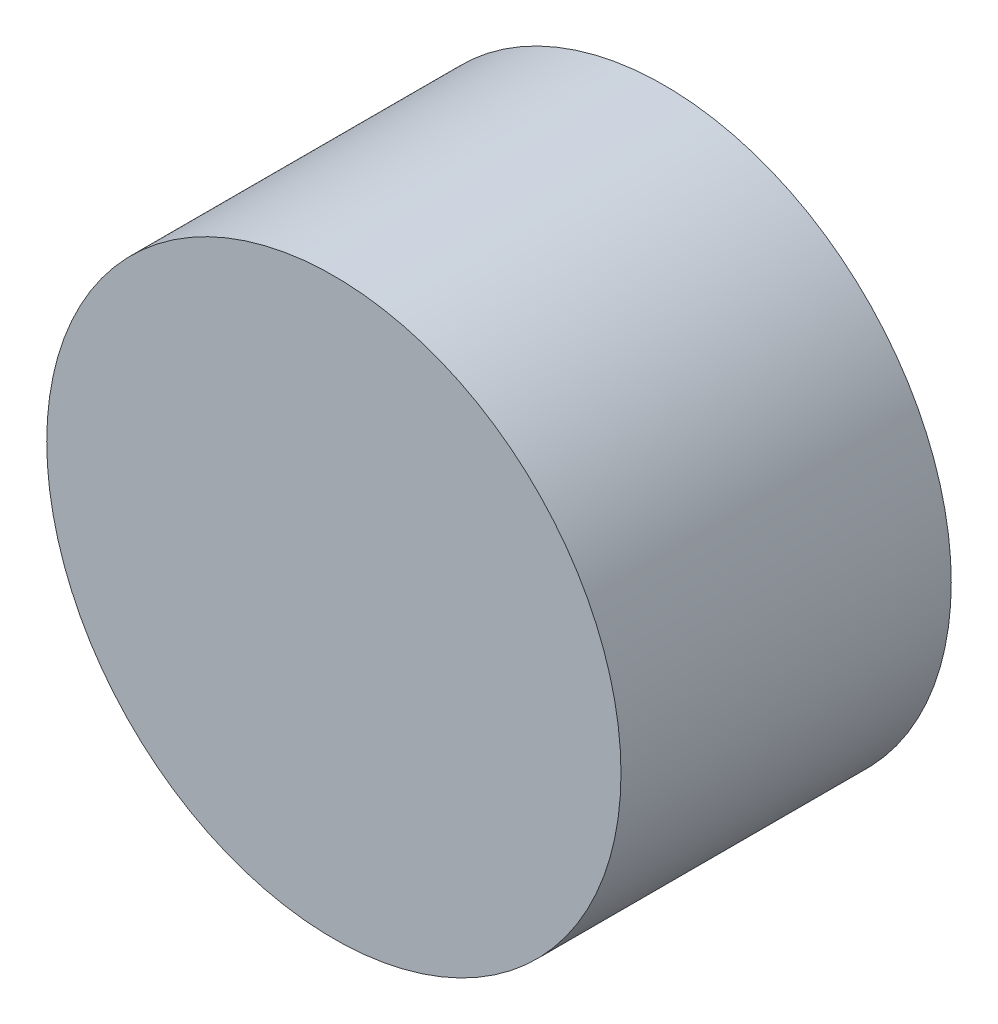
ISO-10303-21;
HEADER;
FILE_DESCRIPTION(('STEP AP214'),'2;1');
FILE_NAME('part.step','',(''),(''),'','','');
FILE_SCHEMA(('AUTOMOTIVE_DESIGN { 1 0 10303 214 1 1 1 1 }'));
ENDSEC;
DATA;
#1=APPLICATION_CONTEXT('core data for automotive mechanical design processes');
#2=APPLICATION_PROTOCOL_DEFINITION('international standard','automotive_design',2000,#1);
#3=PRODUCT_CONTEXT('',#1,'mechanical');
#4=PRODUCT('Part','Part','',(#3));
#5=PRODUCT_RELATED_PRODUCT_CATEGORY('part','',(#4));
#6=PRODUCT_DEFINITION_FORMATION('','',#4);
#7=PRODUCT_DEFINITION_CONTEXT('part definition',#1,'design');
#8=PRODUCT_DEFINITION('design','',#6,#7);
#9=PRODUCT_DEFINITION_SHAPE('','',#8);
#10=(LENGTH_UNIT() NAMED_UNIT(*) SI_UNIT(.MILLI.,.METRE.));
#11=(NAMED_UNIT(*) PLANE_ANGLE_UNIT() SI_UNIT($,.RADIAN.));
#12=(NAMED_UNIT(*) SI_UNIT($,.STERADIAN.) SOLID_ANGLE_UNIT());
#13=UNCERTAINTY_MEASURE_WITH_UNIT(LENGTH_MEASURE(1.E-05),#10,'distance_accuracy_value','');
#14=(GEOMETRIC_REPRESENTATION_CONTEXT(3) GLOBAL_UNCERTAINTY_ASSIGNED_CONTEXT((#13)) GLOBAL_UNIT_ASSIGNED_CONTEXT((#10,
#11,#12)) REPRESENTATION_CONTEXT('',''));
#15=CARTESIAN_POINT('',(0.,0.,0.));
#16=DIRECTION('',(0.,0.,1.));
#17=DIRECTION('',(1.,0.,0.));
#18=AXIS2_PLACEMENT_3D('',#15,#16,#17);
#19=CARTESIAN_POINT('',(0.,0.,10.));
#20=DIRECTION('',(0.,0.,-1.));
#21=DIRECTION('',(-1.,0.,0.));
#22=AXIS2_PLACEMENT_3D('',#19,#20,#21);
#23=CYLINDRICAL_SURFACE('',#22,8.69360586637149);
#24=CARTESIAN_POINT('',(0.,0.,10.));
#25=DIRECTION('',(0.,0.,1.));
#26=DIRECTION('',(1.,0.,0.));
#27=AXIS2_PLACEMENT_3D('',#24,#25,#26);
#28=CIRCLE('',#27,8.69360586637149);
#29=CARTESIAN_POINT('',(8.69360586637149,0.,10.));
#30=VERTEX_POINT('',#29);
#31=EDGE_CURVE('E10',#30,#30,#28,.T.);
#32=ORIENTED_EDGE('',*,*,#31,.F.);
#33=EDGE_LOOP('',(#32));
#34=FACE_BOUND('',#33,.T.);
#35=CARTESIAN_POINT('',(0.,0.,0.));
#36=DIRECTION('',(0.,0.,1.));
#37=DIRECTION('',(1.,0.,0.));
#38=AXIS2_PLACEMENT_3D('',#35,#36,#37);
#39=CIRCLE('',#38,8.69360586637149);
#40=CARTESIAN_POINT('',(8.69360586637149,0.,0.));
#41=VERTEX_POINT('',#40);
#42=EDGE_CURVE('E34',#41,#41,#39,.T.);
#43=ORIENTED_EDGE('',*,*,#42,.T.);
#44=EDGE_LOOP('',(#43));
#45=FACE_BOUND('',#44,.T.);
#46=ADVANCED_FACE('F31',(#34,#45),#23,.T.);
#47=CARTESIAN_POINT('',(0.,0.,10.));
#48=DIRECTION('',(0.,0.,1.));
#49=DIRECTION('',(1.,0.,0.));
#50=AXIS2_PLACEMENT_3D('',#47,#48,#49);
#51=PLANE('',#50);
#52=ORIENTED_EDGE('',*,*,#31,.T.);
#53=EDGE_LOOP('',(#52));
#54=FACE_BOUND('',#53,.T.);
#55=ADVANCED_FACE('F46',(#54),#51,.T.);
#56=CARTESIAN_POINT('',(0.,0.,0.));
#57=DIRECTION('',(0.,0.,1.));
#58=DIRECTION('',(1.,0.,0.));
#59=AXIS2_PLACEMENT_3D('',#56,#57,#58);
#60=PLANE('',#59);
#61=ORIENTED_EDGE('',*,*,#42,.F.);
#62=EDGE_LOOP('',(#61));
#63=FACE_BOUND('',#62,.T.);
#64=ADVANCED_FACE('F44',(#63),#60,.F.);
#65=CLOSED_SHELL('',(#46,#55,#64));
#66=MANIFOLD_SOLID_BREP('B2',#65);
#67=ADVANCED_BREP_SHAPE_REPRESENTATION('',(#18,#66),#14);
#68=SHAPE_DEFINITION_REPRESENTATION(#9,#67);
ENDSEC;
END-ISO-10303-21;
